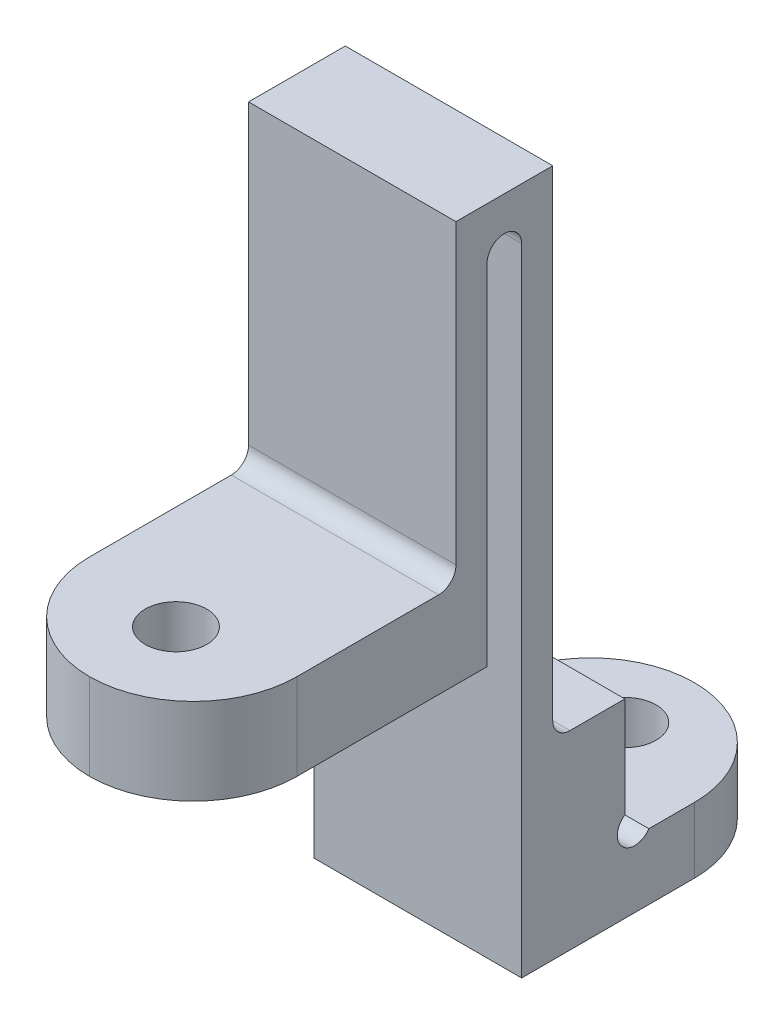
ISO-10303-21;
HEADER;
FILE_DESCRIPTION(('STEP AP214'),'2;1');
FILE_NAME('part.step','',(''),(''),'','','');
FILE_SCHEMA(('AUTOMOTIVE_DESIGN { 1 0 10303 214 1 1 1 1 }'));
ENDSEC;
DATA;
#1=APPLICATION_CONTEXT('core data for automotive mechanical design processes');
#2=APPLICATION_PROTOCOL_DEFINITION('international standard','automotive_design',2000,#1);
#3=PRODUCT_CONTEXT('',#1,'mechanical');
#4=PRODUCT('Part','Part','',(#3));
#5=PRODUCT_RELATED_PRODUCT_CATEGORY('part','',(#4));
#6=PRODUCT_DEFINITION_FORMATION('','',#4);
#7=PRODUCT_DEFINITION_CONTEXT('part definition',#1,'design');
#8=PRODUCT_DEFINITION('design','',#6,#7);
#9=PRODUCT_DEFINITION_SHAPE('','',#8);
#10=(LENGTH_UNIT() NAMED_UNIT(*) SI_UNIT(.MILLI.,.METRE.));
#11=(NAMED_UNIT(*) PLANE_ANGLE_UNIT() SI_UNIT($,.RADIAN.));
#12=(NAMED_UNIT(*) SI_UNIT($,.STERADIAN.) SOLID_ANGLE_UNIT());
#13=UNCERTAINTY_MEASURE_WITH_UNIT(LENGTH_MEASURE(1.E-05),#10,'distance_accuracy_value','');
#14=(GEOMETRIC_REPRESENTATION_CONTEXT(3) GLOBAL_UNCERTAINTY_ASSIGNED_CONTEXT((#13)) GLOBAL_UNIT_ASSIGNED_CONTEXT((#10,
#11,#12)) REPRESENTATION_CONTEXT('',''));
#15=CARTESIAN_POINT('',(0.,0.,0.));
#16=DIRECTION('',(0.,0.,1.));
#17=DIRECTION('',(1.,0.,0.));
#18=AXIS2_PLACEMENT_3D('',#15,#16,#17);
#19=CARTESIAN_POINT('',(1.5,-2.90242290122199,1.));
#20=DIRECTION('',(0.,-1.,0.));
#21=DIRECTION('',(0.,0.,-1.));
#22=AXIS2_PLACEMENT_3D('',#19,#20,#21);
#23=PLANE('',#22);
#24=CARTESIAN_POINT('',(4.5,-2.902422901222,-5.));
#25=DIRECTION('',(0.,1.,0.));
#26=DIRECTION('',(0.,0.,1.));
#27=AXIS2_PLACEMENT_3D('',#24,#25,#26);
#28=CIRCLE('',#27,0.888999999999999);
#29=CARTESIAN_POINT('',(4.5,-2.902422901222,-4.111));
#30=VERTEX_POINT('',#29);
#31=EDGE_CURVE('E487',#30,#30,#28,.T.);
#32=ORIENTED_EDGE('',*,*,#31,.T.);
#33=EDGE_LOOP('',(#32));
#34=FACE_BOUND('',#33,.T.);
#35=CARTESIAN_POINT('',(4.5,-2.90242290122199,-4.));
#36=DIRECTION('',(0.,-1.,0.));
#37=DIRECTION('',(0.,0.,-1.));
#38=AXIS2_PLACEMENT_3D('',#35,#36,#37);
#39=CIRCLE('',#38,3.);
#40=CARTESIAN_POINT('',(1.5,-2.90242290122199,-4.));
#41=VERTEX_POINT('',#40);
#42=CARTESIAN_POINT('',(4.5,-2.90242290122199,-7.));
#43=VERTEX_POINT('',#42);
#44=EDGE_CURVE('E315',#41,#43,#39,.T.);
#45=ORIENTED_EDGE('',*,*,#44,.T.);
#46=CARTESIAN_POINT('',(4.5,-2.90242290122199,-4.));
#47=DIRECTION('',(0.,-1.,0.));
#48=DIRECTION('',(0.,0.,-1.));
#49=AXIS2_PLACEMENT_3D('',#46,#47,#48);
#50=CIRCLE('',#49,3.);
#51=CARTESIAN_POINT('',(7.5,-2.90242290122199,-4.));
#52=VERTEX_POINT('',#51);
#53=EDGE_CURVE('E318',#43,#52,#50,.T.);
#54=ORIENTED_EDGE('',*,*,#53,.T.);
#55=DIRECTION('',(0.,0.,-1.));
#56=VECTOR('',#55,1.);
#57=CARTESIAN_POINT('',(7.5,-2.90242290122199,1.));
#58=LINE('',#57,#56);
#59=CARTESIAN_POINT('',(7.5,-2.90242290122199,1.));
#60=VERTEX_POINT('',#59);
#61=EDGE_CURVE('E244',#60,#52,#58,.T.);
#62=ORIENTED_EDGE('',*,*,#61,.F.);
#63=DIRECTION('',(1.,0.,0.));
#64=VECTOR('',#63,1.);
#65=CARTESIAN_POINT('',(1.5,-2.90242290122199,1.));
#66=LINE('',#65,#64);
#67=CARTESIAN_POINT('',(1.5,-2.90242290122199,1.));
#68=VERTEX_POINT('',#67);
#69=EDGE_CURVE('E285',#68,#60,#66,.T.);
#70=ORIENTED_EDGE('',*,*,#69,.F.);
#71=DIRECTION('',(0.,0.,-1.));
#72=VECTOR('',#71,1.);
#73=CARTESIAN_POINT('',(1.5,-2.90242290122199,1.));
#74=LINE('',#73,#72);
#75=EDGE_CURVE('E259',#68,#41,#74,.T.);
#76=ORIENTED_EDGE('',*,*,#75,.T.);
#77=EDGE_LOOP('',(#45,#54,#62,#70,#76));
#78=FACE_BOUND('',#77,.T.);
#79=ADVANCED_FACE('F45',(#34,#78),#23,.T.);
#80=CARTESIAN_POINT('',(1.5,-2.90242290122199,1.));
#81=DIRECTION('',(0.,0.,1.));
#82=DIRECTION('',(1.,0.,0.));
#83=AXIS2_PLACEMENT_3D('',#80,#81,#82);
#84=PLANE('',#83);
#85=DIRECTION('',(0.,-1.,0.));
#86=VECTOR('',#85,1.);
#87=CARTESIAN_POINT('',(7.5,-2.90242290122199,1.));
#88=LINE('',#87,#86);
#89=CARTESIAN_POINT('',(7.5,15.497577098778,1.));
#90=VERTEX_POINT('',#89);
#91=EDGE_CURVE('E278',#90,#60,#88,.T.);
#92=ORIENTED_EDGE('',*,*,#91,.F.);
#93=DIRECTION('',(1.,0.,0.));
#94=VECTOR('',#93,1.);
#95=CARTESIAN_POINT('',(1.5,15.497577098778,1.));
#96=LINE('',#95,#94);
#97=CARTESIAN_POINT('',(1.5,15.497577098778,1.));
#98=VERTEX_POINT('',#97);
#99=EDGE_CURVE('E289',#98,#90,#96,.T.);
#100=ORIENTED_EDGE('',*,*,#99,.F.);
#101=DIRECTION('',(0.,-1.,0.));
#102=VECTOR('',#101,1.);
#103=CARTESIAN_POINT('',(1.5,-2.90242290122199,1.));
#104=LINE('',#103,#102);
#105=EDGE_CURVE('E255',#98,#68,#104,.T.);
#106=ORIENTED_EDGE('',*,*,#105,.T.);
#107=ORIENTED_EDGE('',*,*,#69,.T.);
#108=EDGE_LOOP('',(#92,#100,#106,#107));
#109=FACE_BOUND('',#108,.T.);
#110=ADVANCED_FACE('F416',(#109),#84,.T.);
#111=CARTESIAN_POINT('',(1.5,15.497577098778,1.5));
#112=DIRECTION('',(1.,0.,0.));
#113=DIRECTION('',(0.,0.,-1.));
#114=AXIS2_PLACEMENT_3D('',#111,#112,#113);
#115=CYLINDRICAL_SURFACE('',#114,0.5);
#116=CARTESIAN_POINT('',(7.5,15.497577098778,1.5));
#117=DIRECTION('',(-1.,0.,0.));
#118=DIRECTION('',(0.,0.,1.));
#119=AXIS2_PLACEMENT_3D('',#116,#117,#118);
#120=CIRCLE('',#119,0.5);
#121=CARTESIAN_POINT('',(7.5,15.497577098778,2.));
#122=VERTEX_POINT('',#121);
#123=EDGE_CURVE('E274',#122,#90,#120,.T.);
#124=ORIENTED_EDGE('',*,*,#123,.F.);
#125=DIRECTION('',(1.,0.,0.));
#126=VECTOR('',#125,1.);
#127=CARTESIAN_POINT('',(1.5,15.497577098778,2.));
#128=LINE('',#127,#126);
#129=CARTESIAN_POINT('',(1.5,15.497577098778,2.));
#130=VERTEX_POINT('',#129);
#131=EDGE_CURVE('E292',#130,#122,#128,.T.);
#132=ORIENTED_EDGE('',*,*,#131,.F.);
#133=CARTESIAN_POINT('',(1.5,15.497577098778,1.5));
#134=DIRECTION('',(-1.,0.,0.));
#135=DIRECTION('',(0.,0.,1.));
#136=AXIS2_PLACEMENT_3D('',#133,#134,#135);
#137=CIRCLE('',#136,0.5);
#138=EDGE_CURVE('E251',#130,#98,#137,.T.);
#139=ORIENTED_EDGE('',*,*,#138,.T.);
#140=ORIENTED_EDGE('',*,*,#99,.T.);
#141=EDGE_LOOP('',(#124,#132,#139,#140));
#142=FACE_BOUND('',#141,.T.);
#143=ADVANCED_FACE('F422',(#142),#115,.F.);
#144=CARTESIAN_POINT('',(1.5,5.39757709877801,2.));
#145=DIRECTION('',(0.,0.,-1.));
#146=DIRECTION('',(-1.,0.,0.));
#147=AXIS2_PLACEMENT_3D('',#144,#145,#146);
#148=PLANE('',#147);
#149=DIRECTION('',(0.,1.,0.));
#150=VECTOR('',#149,1.);
#151=CARTESIAN_POINT('',(7.5,5.39757709877801,2.));
#152=LINE('',#151,#150);
#153=CARTESIAN_POINT('',(7.5,5.39757709877801,2.));
#154=VERTEX_POINT('',#153);
#155=EDGE_CURVE('E270',#154,#122,#152,.T.);
#156=ORIENTED_EDGE('',*,*,#155,.F.);
#157=DIRECTION('',(1.,0.,0.));
#158=VECTOR('',#157,1.);
#159=CARTESIAN_POINT('',(1.5,5.39757709877801,2.));
#160=LINE('',#159,#158);
#161=CARTESIAN_POINT('',(1.5,5.39757709877801,2.));
#162=VERTEX_POINT('',#161);
#163=EDGE_CURVE('E263',#162,#154,#160,.T.);
#164=ORIENTED_EDGE('',*,*,#163,.F.);
#165=DIRECTION('',(0.,1.,0.));
#166=VECTOR('',#165,1.);
#167=CARTESIAN_POINT('',(1.5,5.39757709877801,2.));
#168=LINE('',#167,#166);
#169=EDGE_CURVE('E247',#162,#130,#168,.T.);
#170=ORIENTED_EDGE('',*,*,#169,.T.);
#171=ORIENTED_EDGE('',*,*,#131,.T.);
#172=EDGE_LOOP('',(#156,#164,#170,#171));
#173=FACE_BOUND('',#172,.T.);
#174=ADVANCED_FACE('F432',(#173),#148,.T.);
#175=CARTESIAN_POINT('',(1.5,5.39757709877801,10.5));
#176=DIRECTION('',(0.,-1.,0.));
#177=DIRECTION('',(0.,0.,-1.));
#178=AXIS2_PLACEMENT_3D('',#175,#176,#177);
#179=PLANE('',#178);
#180=CARTESIAN_POINT('',(4.5,5.39757709877801,8.));
#181=DIRECTION('',(0.,-1.,0.));
#182=DIRECTION('',(0.,0.,-1.));
#183=AXIS2_PLACEMENT_3D('',#180,#181,#182);
#184=CIRCLE('',#183,0.888999999999999);
#185=CARTESIAN_POINT('',(4.5,5.39757709877801,7.111));
#186=VERTEX_POINT('',#185);
#187=EDGE_CURVE('E349',#186,#186,#184,.T.);
#188=ORIENTED_EDGE('',*,*,#187,.F.);
#189=EDGE_LOOP('',(#188));
#190=FACE_BOUND('',#189,.T.);
#191=CARTESIAN_POINT('',(4.5,5.39757709877801,7.5));
#192=DIRECTION('',(0.,-1.,0.));
#193=DIRECTION('',(0.,0.,-1.));
#194=AXIS2_PLACEMENT_3D('',#191,#192,#193);
#195=CIRCLE('',#194,3.);
#196=CARTESIAN_POINT('',(7.5,5.39757709877801,7.5));
#197=VERTEX_POINT('',#196);
#198=CARTESIAN_POINT('',(4.5,5.39757709877801,10.5));
#199=VERTEX_POINT('',#198);
#200=EDGE_CURVE('E328',#197,#199,#195,.T.);
#201=ORIENTED_EDGE('',*,*,#200,.T.);
#202=CARTESIAN_POINT('',(4.5,5.39757709877801,7.5));
#203=DIRECTION('',(0.,-1.,0.));
#204=DIRECTION('',(0.,0.,-1.));
#205=AXIS2_PLACEMENT_3D('',#202,#203,#204);
#206=CIRCLE('',#205,3.);
#207=CARTESIAN_POINT('',(1.5,5.39757709877801,7.5));
#208=VERTEX_POINT('',#207);
#209=EDGE_CURVE('E331',#199,#208,#206,.T.);
#210=ORIENTED_EDGE('',*,*,#209,.T.);
#211=DIRECTION('',(0.,0.,-1.));
#212=VECTOR('',#211,1.);
#213=CARTESIAN_POINT('',(1.5,5.39757709877801,10.5));
#214=LINE('',#213,#212);
#215=EDGE_CURVE('E243',#208,#162,#214,.T.);
#216=ORIENTED_EDGE('',*,*,#215,.T.);
#217=ORIENTED_EDGE('',*,*,#163,.T.);
#218=DIRECTION('',(0.,0.,-1.));
#219=VECTOR('',#218,1.);
#220=CARTESIAN_POINT('',(7.5,5.39757709877801,10.5));
#221=LINE('',#220,#219);
#222=EDGE_CURVE('E267',#197,#154,#221,.T.);
#223=ORIENTED_EDGE('',*,*,#222,.F.);
#224=EDGE_LOOP('',(#201,#210,#216,#217,#223));
#225=FACE_BOUND('',#224,.T.);
#226=ADVANCED_FACE('F436',(#190,#225),#179,.T.);
#227=CARTESIAN_POINT('',(1.5,16.997577098778,-7.));
#228=DIRECTION('',(0.,1.,0.));
#229=DIRECTION('',(0.,0.,1.));
#230=AXIS2_PLACEMENT_3D('',#227,#228,#229);
#231=PLANE('',#230);
#232=DIRECTION('',(-1.,0.,0.));
#233=VECTOR('',#232,1.);
#234=CARTESIAN_POINT('',(1.5,16.997577098778,2.9));
#235=LINE('',#234,#233);
#236=CARTESIAN_POINT('',(7.5,16.997577098778,2.9));
#237=VERTEX_POINT('',#236);
#238=CARTESIAN_POINT('',(1.5,16.997577098778,2.9));
#239=VERTEX_POINT('',#238);
#240=EDGE_CURVE('E235',#237,#239,#235,.T.);
#241=ORIENTED_EDGE('',*,*,#240,.F.);
#242=DIRECTION('',(0.,0.,1.));
#243=VECTOR('',#242,1.);
#244=CARTESIAN_POINT('',(7.5,16.997577098778,-7.));
#245=LINE('',#244,#243);
#246=CARTESIAN_POINT('',(7.5,16.997577098778,0.1));
#247=VERTEX_POINT('',#246);
#248=EDGE_CURVE('E238',#247,#237,#245,.T.);
#249=ORIENTED_EDGE('',*,*,#248,.F.);
#250=DIRECTION('',(1.,0.,0.));
#251=VECTOR('',#250,1.);
#252=CARTESIAN_POINT('',(1.5,16.997577098778,0.1));
#253=LINE('',#252,#251);
#254=CARTESIAN_POINT('',(1.5,16.997577098778,0.1));
#255=VERTEX_POINT('',#254);
#256=EDGE_CURVE('E220',#255,#247,#253,.T.);
#257=ORIENTED_EDGE('',*,*,#256,.F.);
#258=DIRECTION('',(0.,0.,1.));
#259=VECTOR('',#258,1.);
#260=CARTESIAN_POINT('',(1.5,16.997577098778,-7.));
#261=LINE('',#260,#259);
#262=EDGE_CURVE('E239',#255,#239,#261,.T.);
#263=ORIENTED_EDGE('',*,*,#262,.T.);
#264=EDGE_LOOP('',(#241,#249,#257,#263));
#265=FACE_BOUND('',#264,.T.);
#266=ADVANCED_FACE('F390',(#265),#231,.T.);
#267=CARTESIAN_POINT('',(1.5,15.497577098778,1.5));
#268=DIRECTION('',(-1.,0.,0.));
#269=DIRECTION('',(0.,0.,1.));
#270=AXIS2_PLACEMENT_3D('',#267,#268,#269);
#271=PLANE('',#270);
#272=CARTESIAN_POINT('',(1.5,-0.719580188747369,-2.26914504299253));
#273=DIRECTION('',(1.,0.,0.));
#274=DIRECTION('',(0.,0.,-1.));
#275=AXIS2_PLACEMENT_3D('',#272,#273,#274);
#276=CIRCLE('',#275,0.499999999999999);
#277=CARTESIAN_POINT('',(1.5,-0.307269626185604,-1.98630233051791));
#278=VERTEX_POINT('',#277);
#279=CARTESIAN_POINT('',(1.5,-1.00242290122199,-2.68145560555429));
#280=VERTEX_POINT('',#279);
#281=EDGE_CURVE('E178',#278,#280,#276,.T.);
#282=ORIENTED_EDGE('',*,*,#281,.T.);
#283=DIRECTION('',(0.,0.,1.));
#284=VECTOR('',#283,1.);
#285=CARTESIAN_POINT('',(1.5,-1.00242290122199,-1.98630233051791));
#286=LINE('',#285,#284);
#287=CARTESIAN_POINT('',(1.5,-1.00242290122199,-4.));
#288=VERTEX_POINT('',#287);
#289=EDGE_CURVE('E210',#288,#280,#286,.T.);
#290=ORIENTED_EDGE('',*,*,#289,.F.);
#291=DIRECTION('',(0.,1.,0.));
#292=VECTOR('',#291,1.);
#293=CARTESIAN_POINT('',(1.5,15.497577098778,-4.));
#294=LINE('',#293,#292);
#295=EDGE_CURVE('E325',#288,#41,#294,.F.);
#296=ORIENTED_EDGE('',*,*,#295,.T.);
#297=ORIENTED_EDGE('',*,*,#75,.F.);
#298=ORIENTED_EDGE('',*,*,#105,.F.);
#299=ORIENTED_EDGE('',*,*,#138,.F.);
#300=ORIENTED_EDGE('',*,*,#169,.F.);
#301=ORIENTED_EDGE('',*,*,#215,.F.);
#302=DIRECTION('',(0.,-1.,0.));
#303=VECTOR('',#302,1.);
#304=CARTESIAN_POINT('',(1.5,15.497577098778,7.5));
#305=LINE('',#304,#303);
#306=CARTESIAN_POINT('',(1.5,7.89757709877801,7.5));
#307=VERTEX_POINT('',#306);
#308=EDGE_CURVE('E321',#208,#307,#305,.F.);
#309=ORIENTED_EDGE('',*,*,#308,.T.);
#310=DIRECTION('',(0.,0.,1.));
#311=VECTOR('',#310,1.);
#312=CARTESIAN_POINT('',(1.5,7.89757709877801,2.9));
#313=LINE('',#312,#311);
#314=CARTESIAN_POINT('',(1.5,7.89757709877801,3.4));
#315=VERTEX_POINT('',#314);
#316=EDGE_CURVE('E204',#315,#307,#313,.T.);
#317=ORIENTED_EDGE('',*,*,#316,.F.);
#318=CARTESIAN_POINT('',(1.5,8.39757709877801,3.4));
#319=DIRECTION('',(-1.,0.,0.));
#320=DIRECTION('',(0.,0.,1.));
#321=AXIS2_PLACEMENT_3D('',#318,#319,#320);
#322=CIRCLE('',#321,0.5);
#323=CARTESIAN_POINT('',(1.5,8.39757709877802,2.9));
#324=VERTEX_POINT('',#323);
#325=EDGE_CURVE('E368',#315,#324,#322,.F.);
#326=ORIENTED_EDGE('',*,*,#325,.T.);
#327=DIRECTION('',(0.,-1.,0.));
#328=VECTOR('',#327,1.);
#329=CARTESIAN_POINT('',(1.5,17.497577098778,2.9));
#330=LINE('',#329,#328);
#331=EDGE_CURVE('E217',#239,#324,#330,.T.);
#332=ORIENTED_EDGE('',*,*,#331,.F.);
#333=ORIENTED_EDGE('',*,*,#262,.F.);
#334=DIRECTION('',(0.,1.,0.));
#335=VECTOR('',#334,1.);
#336=CARTESIAN_POINT('',(1.5,17.497577098778,0.1));
#337=LINE('',#336,#335);
#338=CARTESIAN_POINT('',(1.5,3.09757709877801,0.100000000000003));
#339=VERTEX_POINT('',#338);
#340=EDGE_CURVE('E224',#339,#255,#337,.T.);
#341=ORIENTED_EDGE('',*,*,#340,.F.);
#342=CARTESIAN_POINT('',(1.5,3.09757709877801,-0.399999999999997));
#343=DIRECTION('',(-1.,0.,0.));
#344=DIRECTION('',(0.,0.,1.));
#345=AXIS2_PLACEMENT_3D('',#342,#343,#344);
#346=CIRCLE('',#345,0.5);
#347=CARTESIAN_POINT('',(1.5,2.59757709877801,-0.399999999999997));
#348=VERTEX_POINT('',#347);
#349=EDGE_CURVE('E362',#339,#348,#346,.F.);
#350=ORIENTED_EDGE('',*,*,#349,.T.);
#351=DIRECTION('',(0.,0.,1.));
#352=VECTOR('',#351,1.);
#353=CARTESIAN_POINT('',(1.5,2.59757709877801,0.100000000000003));
#354=LINE('',#353,#352);
#355=CARTESIAN_POINT('',(1.5,2.59757709877801,-1.98630233051791));
#356=VERTEX_POINT('',#355);
#357=EDGE_CURVE('E225',#356,#348,#354,.T.);
#358=ORIENTED_EDGE('',*,*,#357,.F.);
#359=DIRECTION('',(0.,1.,0.));
#360=VECTOR('',#359,1.);
#361=CARTESIAN_POINT('',(1.5,-1.00242290122199,-1.98630233051791));
#362=LINE('',#361,#360);
#363=EDGE_CURVE('E206',#278,#356,#362,.T.);
#364=ORIENTED_EDGE('',*,*,#363,.F.);
#365=EDGE_LOOP('',(#282,#290,#296,#297,#298,#299,#300,#301,#309,#317,#326,#332,#333,#341,#350,
#358,#364));
#366=FACE_BOUND('',#365,.T.);
#367=ADVANCED_FACE('F384',(#366),#271,.T.);
#368=CARTESIAN_POINT('',(7.5,15.497577098778,1.5));
#369=DIRECTION('',(-1.,0.,0.));
#370=DIRECTION('',(0.,0.,1.));
#371=AXIS2_PLACEMENT_3D('',#368,#369,#370);
#372=PLANE('',#371);
#373=DIRECTION('',(0.,0.,1.));
#374=VECTOR('',#373,1.);
#375=CARTESIAN_POINT('',(7.5,-1.00242290122199,-1.98630233051791));
#376=LINE('',#375,#374);
#377=CARTESIAN_POINT('',(7.5,-1.00242290122199,-4.));
#378=VERTEX_POINT('',#377);
#379=CARTESIAN_POINT('',(7.5,-1.00242290122199,-2.68145560555429));
#380=VERTEX_POINT('',#379);
#381=EDGE_CURVE('E193',#378,#380,#376,.T.);
#382=ORIENTED_EDGE('',*,*,#381,.T.);
#383=CARTESIAN_POINT('',(7.5,-0.719580188747369,-2.26914504299253));
#384=DIRECTION('',(1.,0.,0.));
#385=DIRECTION('',(0.,0.,-1.));
#386=AXIS2_PLACEMENT_3D('',#383,#384,#385);
#387=CIRCLE('',#386,0.499999999999999);
#388=CARTESIAN_POINT('',(7.5,-0.307269626185604,-1.98630233051791));
#389=VERTEX_POINT('',#388);
#390=EDGE_CURVE('E61',#389,#380,#387,.T.);
#391=ORIENTED_EDGE('',*,*,#390,.F.);
#392=DIRECTION('',(0.,1.,0.));
#393=VECTOR('',#392,1.);
#394=CARTESIAN_POINT('',(7.5,-1.00242290122199,-1.98630233051791));
#395=LINE('',#394,#393);
#396=CARTESIAN_POINT('',(7.5,2.59757709877801,-1.98630233051791));
#397=VERTEX_POINT('',#396);
#398=EDGE_CURVE('E189',#389,#397,#395,.T.);
#399=ORIENTED_EDGE('',*,*,#398,.T.);
#400=DIRECTION('',(0.,0.,1.));
#401=VECTOR('',#400,1.);
#402=CARTESIAN_POINT('',(7.5,2.59757709877801,1.5));
#403=LINE('',#402,#401);
#404=CARTESIAN_POINT('',(7.5,2.59757709877801,-0.399999999999997));
#405=VERTEX_POINT('',#404);
#406=EDGE_CURVE('E288',#397,#405,#403,.T.);
#407=ORIENTED_EDGE('',*,*,#406,.T.);
#408=CARTESIAN_POINT('',(7.5,3.09757709877801,-0.399999999999997));
#409=DIRECTION('',(-1.,0.,0.));
#410=DIRECTION('',(0.,0.,1.));
#411=AXIS2_PLACEMENT_3D('',#408,#409,#410);
#412=CIRCLE('',#411,0.5);
#413=CARTESIAN_POINT('',(7.5,3.09757709877801,0.100000000000003));
#414=VERTEX_POINT('',#413);
#415=EDGE_CURVE('E365',#405,#414,#412,.T.);
#416=ORIENTED_EDGE('',*,*,#415,.T.);
#417=DIRECTION('',(0.,1.,0.));
#418=VECTOR('',#417,1.);
#419=CARTESIAN_POINT('',(7.5,17.497577098778,0.1));
#420=LINE('',#419,#418);
#421=EDGE_CURVE('E221',#414,#247,#420,.T.);
#422=ORIENTED_EDGE('',*,*,#421,.T.);
#423=ORIENTED_EDGE('',*,*,#248,.T.);
#424=DIRECTION('',(0.,-1.,0.));
#425=VECTOR('',#424,1.);
#426=CARTESIAN_POINT('',(7.5,15.497577098778,2.9));
#427=LINE('',#426,#425);
#428=CARTESIAN_POINT('',(7.5,8.39757709877801,2.9));
#429=VERTEX_POINT('',#428);
#430=EDGE_CURVE('E300',#237,#429,#427,.T.);
#431=ORIENTED_EDGE('',*,*,#430,.T.);
#432=CARTESIAN_POINT('',(7.5,8.39757709877801,3.4));
#433=DIRECTION('',(-1.,0.,0.));
#434=DIRECTION('',(0.,0.,1.));
#435=AXIS2_PLACEMENT_3D('',#432,#433,#434);
#436=CIRCLE('',#435,0.5);
#437=CARTESIAN_POINT('',(7.5,7.89757709877801,3.4));
#438=VERTEX_POINT('',#437);
#439=EDGE_CURVE('E54',#429,#438,#436,.T.);
#440=ORIENTED_EDGE('',*,*,#439,.T.);
#441=DIRECTION('',(0.,0.,1.));
#442=VECTOR('',#441,1.);
#443=CARTESIAN_POINT('',(7.5,7.89757709877801,2.9));
#444=LINE('',#443,#442);
#445=CARTESIAN_POINT('',(7.5,7.89757709877801,7.5));
#446=VERTEX_POINT('',#445);
#447=EDGE_CURVE('E229',#438,#446,#444,.T.);
#448=ORIENTED_EDGE('',*,*,#447,.T.);
#449=DIRECTION('',(0.,-1.,0.));
#450=VECTOR('',#449,1.);
#451=CARTESIAN_POINT('',(7.5,5.39757709877801,7.5));
#452=LINE('',#451,#450);
#453=EDGE_CURVE('E303',#446,#197,#452,.T.);
#454=ORIENTED_EDGE('',*,*,#453,.T.);
#455=ORIENTED_EDGE('',*,*,#222,.T.);
#456=ORIENTED_EDGE('',*,*,#155,.T.);
#457=ORIENTED_EDGE('',*,*,#123,.T.);
#458=ORIENTED_EDGE('',*,*,#91,.T.);
#459=ORIENTED_EDGE('',*,*,#61,.T.);
#460=DIRECTION('',(0.,1.,0.));
#461=VECTOR('',#460,1.);
#462=CARTESIAN_POINT('',(7.5,-1.00242290122199,-4.));
#463=LINE('',#462,#461);
#464=EDGE_CURVE('E306',#52,#378,#463,.T.);
#465=ORIENTED_EDGE('',*,*,#464,.T.);
#466=EDGE_LOOP('',(#382,#391,#399,#407,#416,#422,#423,#431,#440,#448,#454,#455,#456,#457,#458,
#459,#465));
#467=FACE_BOUND('',#466,.T.);
#468=ADVANCED_FACE('F187',(#467),#372,.F.);
#469=CARTESIAN_POINT('',(7.5,17.497577098778,0.1));
#470=DIRECTION('',(0.,0.,1.));
#471=DIRECTION('',(0.,-1.,0.));
#472=AXIS2_PLACEMENT_3D('',#469,#470,#471);
#473=PLANE('',#472);
#474=ORIENTED_EDGE('',*,*,#421,.F.);
#475=DIRECTION('',(-1.,0.,0.));
#476=VECTOR('',#475,1.);
#477=CARTESIAN_POINT('',(1.5,3.09757709877801,0.100000000000003));
#478=LINE('',#477,#476);
#479=EDGE_CURVE('E341',#414,#339,#478,.T.);
#480=ORIENTED_EDGE('',*,*,#479,.T.);
#481=ORIENTED_EDGE('',*,*,#340,.T.);
#482=ORIENTED_EDGE('',*,*,#256,.T.);
#483=EDGE_LOOP('',(#474,#480,#481,#482));
#484=FACE_BOUND('',#483,.T.);
#485=ADVANCED_FACE('F396',(#484),#473,.F.);
#486=CARTESIAN_POINT('',(7.5,2.59757709877801,0.100000000000003));
#487=DIRECTION('',(0.,-1.,0.));
#488=DIRECTION('',(0.,0.,-1.));
#489=AXIS2_PLACEMENT_3D('',#486,#487,#488);
#490=PLANE('',#489);
#491=ORIENTED_EDGE('',*,*,#357,.T.);
#492=DIRECTION('',(-1.,0.,0.));
#493=VECTOR('',#492,1.);
#494=CARTESIAN_POINT('',(7.5,2.59757709877801,-0.399999999999997));
#495=LINE('',#494,#493);
#496=EDGE_CURVE('E353',#348,#405,#495,.F.);
#497=ORIENTED_EDGE('',*,*,#496,.T.);
#498=ORIENTED_EDGE('',*,*,#406,.F.);
#499=DIRECTION('',(-1.,0.,0.));
#500=VECTOR('',#499,1.);
#501=CARTESIAN_POINT('',(7.5,2.59757709877801,-1.98630233051791));
#502=LINE('',#501,#500);
#503=EDGE_CURVE('E198',#397,#356,#502,.T.);
#504=ORIENTED_EDGE('',*,*,#503,.T.);
#505=EDGE_LOOP('',(#491,#497,#498,#504));
#506=FACE_BOUND('',#505,.T.);
#507=ADVANCED_FACE('F402',(#506),#490,.F.);
#508=CARTESIAN_POINT('',(7.5,17.497577098778,2.9));
#509=DIRECTION('',(0.,0.,-1.));
#510=DIRECTION('',(0.,1.,0.));
#511=AXIS2_PLACEMENT_3D('',#508,#509,#510);
#512=PLANE('',#511);
#513=ORIENTED_EDGE('',*,*,#331,.T.);
#514=DIRECTION('',(-1.,0.,0.));
#515=VECTOR('',#514,1.);
#516=CARTESIAN_POINT('',(7.5,8.39757709877801,2.9));
#517=LINE('',#516,#515);
#518=EDGE_CURVE('E68',#324,#429,#517,.F.);
#519=ORIENTED_EDGE('',*,*,#518,.T.);
#520=ORIENTED_EDGE('',*,*,#430,.F.);
#521=ORIENTED_EDGE('',*,*,#240,.T.);
#522=EDGE_LOOP('',(#513,#519,#520,#521));
#523=FACE_BOUND('',#522,.T.);
#524=ADVANCED_FACE('F386',(#523),#512,.F.);
#525=CARTESIAN_POINT('',(7.5,7.89757709877801,2.9));
#526=DIRECTION('',(0.,-1.,0.));
#527=DIRECTION('',(0.,0.,-1.));
#528=AXIS2_PLACEMENT_3D('',#525,#526,#527);
#529=PLANE('',#528);
#530=CARTESIAN_POINT('',(4.5,7.89757709877801,8.));
#531=DIRECTION('',(0.,1.,0.));
#532=DIRECTION('',(0.,0.,1.));
#533=AXIS2_PLACEMENT_3D('',#530,#531,#532);
#534=CIRCLE('',#533,0.889);
#535=CARTESIAN_POINT('',(4.5,7.89757709877801,8.889));
#536=VERTEX_POINT('',#535);
#537=EDGE_CURVE('E490',#536,#536,#534,.T.);
#538=ORIENTED_EDGE('',*,*,#537,.F.);
#539=EDGE_LOOP('',(#538));
#540=FACE_BOUND('',#539,.T.);
#541=ORIENTED_EDGE('',*,*,#447,.F.);
#542=DIRECTION('',(-1.,0.,0.));
#543=VECTOR('',#542,1.);
#544=CARTESIAN_POINT('',(1.5,7.89757709877801,3.4));
#545=LINE('',#544,#543);
#546=EDGE_CURVE('E356',#438,#315,#545,.T.);
#547=ORIENTED_EDGE('',*,*,#546,.T.);
#548=ORIENTED_EDGE('',*,*,#316,.T.);
#549=CARTESIAN_POINT('',(4.5,7.89757709877801,7.5));
#550=DIRECTION('',(0.,-1.,0.));
#551=DIRECTION('',(0.,0.,-1.));
#552=AXIS2_PLACEMENT_3D('',#549,#550,#551);
#553=CIRCLE('',#552,3.);
#554=CARTESIAN_POINT('',(4.5,7.89757709877801,10.5));
#555=VERTEX_POINT('',#554);
#556=EDGE_CURVE('E338',#307,#555,#553,.F.);
#557=ORIENTED_EDGE('',*,*,#556,.T.);
#558=CARTESIAN_POINT('',(4.5,7.89757709877801,7.5));
#559=DIRECTION('',(0.,-1.,0.));
#560=DIRECTION('',(0.,0.,-1.));
#561=AXIS2_PLACEMENT_3D('',#558,#559,#560);
#562=CIRCLE('',#561,3.);
#563=EDGE_CURVE('E334',#555,#446,#562,.F.);
#564=ORIENTED_EDGE('',*,*,#563,.T.);
#565=EDGE_LOOP('',(#541,#547,#548,#557,#564));
#566=FACE_BOUND('',#565,.T.);
#567=ADVANCED_FACE('F376',(#540,#566),#529,.F.);
#568=CARTESIAN_POINT('',(7.5,-1.00242290122199,-1.98630233051791));
#569=DIRECTION('',(0.,0.,1.));
#570=DIRECTION('',(0.,-1.,0.));
#571=AXIS2_PLACEMENT_3D('',#568,#569,#570);
#572=PLANE('',#571);
#573=ORIENTED_EDGE('',*,*,#398,.F.);
#574=DIRECTION('',(1.,0.,0.));
#575=VECTOR('',#574,1.);
#576=CARTESIAN_POINT('',(1.5,-0.307269626185604,-1.98630233051791));
#577=LINE('',#576,#575);
#578=EDGE_CURVE('E175',#389,#278,#577,.F.);
#579=ORIENTED_EDGE('',*,*,#578,.T.);
#580=ORIENTED_EDGE('',*,*,#363,.T.);
#581=ORIENTED_EDGE('',*,*,#503,.F.);
#582=EDGE_LOOP('',(#573,#579,#580,#581));
#583=FACE_BOUND('',#582,.T.);
#584=ADVANCED_FACE('F196',(#583),#572,.F.);
#585=CARTESIAN_POINT('',(7.5,-1.00242290122199,-1.98630233051791));
#586=DIRECTION('',(0.,-1.,0.));
#587=DIRECTION('',(0.,0.,-1.));
#588=AXIS2_PLACEMENT_3D('',#585,#586,#587);
#589=PLANE('',#588);
#590=CARTESIAN_POINT('',(4.5,-1.00242290122199,-5.));
#591=DIRECTION('',(0.,1.,0.));
#592=DIRECTION('',(0.,0.,1.));
#593=AXIS2_PLACEMENT_3D('',#590,#591,#592);
#594=CIRCLE('',#593,0.888999999999999);
#595=CARTESIAN_POINT('',(4.5,-1.00242290122199,-4.111));
#596=VERTEX_POINT('',#595);
#597=EDGE_CURVE('E183',#596,#596,#594,.T.);
#598=ORIENTED_EDGE('',*,*,#597,.F.);
#599=EDGE_LOOP('',(#598));
#600=FACE_BOUND('',#599,.T.);
#601=ORIENTED_EDGE('',*,*,#289,.T.);
#602=DIRECTION('',(1.,0.,0.));
#603=VECTOR('',#602,1.);
#604=CARTESIAN_POINT('',(1.5,-1.00242290122199,-2.68145560555429));
#605=LINE('',#604,#603);
#606=EDGE_CURVE('E11',#280,#380,#605,.T.);
#607=ORIENTED_EDGE('',*,*,#606,.T.);
#608=ORIENTED_EDGE('',*,*,#381,.F.);
#609=CARTESIAN_POINT('',(4.5,-1.00242290122199,-4.));
#610=DIRECTION('',(0.,-1.,0.));
#611=DIRECTION('',(0.,0.,-1.));
#612=AXIS2_PLACEMENT_3D('',#609,#610,#611);
#613=CIRCLE('',#612,3.);
#614=CARTESIAN_POINT('',(4.5,-1.00242290122199,-7.));
#615=VERTEX_POINT('',#614);
#616=EDGE_CURVE('E312',#378,#615,#613,.F.);
#617=ORIENTED_EDGE('',*,*,#616,.T.);
#618=CARTESIAN_POINT('',(4.5,-1.00242290122199,-4.));
#619=DIRECTION('',(0.,-1.,0.));
#620=DIRECTION('',(0.,0.,-1.));
#621=AXIS2_PLACEMENT_3D('',#618,#619,#620);
#622=CIRCLE('',#621,3.);
#623=EDGE_CURVE('E309',#615,#288,#622,.F.);
#624=ORIENTED_EDGE('',*,*,#623,.T.);
#625=EDGE_LOOP('',(#601,#607,#608,#617,#624));
#626=FACE_BOUND('',#625,.T.);
#627=ADVANCED_FACE('F451',(#600,#626),#589,.F.);
#628=CARTESIAN_POINT('',(4.5,-2.90242290122199,-4.));
#629=DIRECTION('',(0.,1.,0.));
#630=DIRECTION('',(0.,0.,1.));
#631=AXIS2_PLACEMENT_3D('',#628,#629,#630);
#632=CYLINDRICAL_SURFACE('',#631,3.);
#633=DIRECTION('',(0.,1.,0.));
#634=VECTOR('',#633,1.);
#635=CARTESIAN_POINT('',(4.5,-2.90242290122199,-7.));
#636=LINE('',#635,#634);
#637=EDGE_CURVE('E214',#43,#615,#636,.T.);
#638=ORIENTED_EDGE('',*,*,#637,.F.);
#639=ORIENTED_EDGE('',*,*,#44,.F.);
#640=ORIENTED_EDGE('',*,*,#295,.F.);
#641=ORIENTED_EDGE('',*,*,#623,.F.);
#642=EDGE_LOOP('',(#638,#639,#640,#641));
#643=FACE_BOUND('',#642,.T.);
#644=ADVANCED_FACE('F447',(#643),#632,.T.);
#645=CARTESIAN_POINT('',(4.5,15.497577098778,-4.));
#646=DIRECTION('',(0.,-1.,0.));
#647=DIRECTION('',(0.,0.,-1.));
#648=AXIS2_PLACEMENT_3D('',#645,#646,#647);
#649=CYLINDRICAL_SURFACE('',#648,3.);
#650=ORIENTED_EDGE('',*,*,#53,.F.);
#651=ORIENTED_EDGE('',*,*,#637,.T.);
#652=ORIENTED_EDGE('',*,*,#616,.F.);
#653=ORIENTED_EDGE('',*,*,#464,.F.);
#654=EDGE_LOOP('',(#650,#651,#652,#653));
#655=FACE_BOUND('',#654,.T.);
#656=ADVANCED_FACE('F443',(#655),#649,.T.);
#657=CARTESIAN_POINT('',(4.5,15.497577098778,7.5));
#658=DIRECTION('',(0.,1.,0.));
#659=DIRECTION('',(0.,0.,1.));
#660=AXIS2_PLACEMENT_3D('',#657,#658,#659);
#661=CYLINDRICAL_SURFACE('',#660,3.);
#662=ORIENTED_EDGE('',*,*,#453,.F.);
#663=ORIENTED_EDGE('',*,*,#563,.F.);
#664=DIRECTION('',(0.,-1.,0.));
#665=VECTOR('',#664,1.);
#666=CARTESIAN_POINT('',(4.5,7.89757709877801,10.5));
#667=LINE('',#666,#665);
#668=EDGE_CURVE('E345',#199,#555,#667,.F.);
#669=ORIENTED_EDGE('',*,*,#668,.F.);
#670=ORIENTED_EDGE('',*,*,#200,.F.);
#671=EDGE_LOOP('',(#662,#663,#669,#670));
#672=FACE_BOUND('',#671,.T.);
#673=ADVANCED_FACE('F446',(#672),#661,.T.);
#674=CARTESIAN_POINT('',(4.5,16.997577098778,7.5));
#675=DIRECTION('',(0.,-1.,0.));
#676=DIRECTION('',(0.,0.,-1.));
#677=AXIS2_PLACEMENT_3D('',#674,#675,#676);
#678=CYLINDRICAL_SURFACE('',#677,3.);
#679=ORIENTED_EDGE('',*,*,#556,.F.);
#680=ORIENTED_EDGE('',*,*,#308,.F.);
#681=ORIENTED_EDGE('',*,*,#209,.F.);
#682=ORIENTED_EDGE('',*,*,#668,.T.);
#683=EDGE_LOOP('',(#679,#680,#681,#682));
#684=FACE_BOUND('',#683,.T.);
#685=ADVANCED_FACE('F411',(#684),#678,.T.);
#686=CARTESIAN_POINT('',(4.5,7.89757709877801,8.));
#687=DIRECTION('',(0.,1.,0.));
#688=DIRECTION('',(0.,0.,1.));
#689=AXIS2_PLACEMENT_3D('',#686,#687,#688);
#690=CYLINDRICAL_SURFACE('',#689,0.888999999999999);
#691=ORIENTED_EDGE('',*,*,#187,.T.);
#692=EDGE_LOOP('',(#691));
#693=FACE_BOUND('',#692,.T.);
#694=ORIENTED_EDGE('',*,*,#537,.T.);
#695=EDGE_LOOP('',(#694));
#696=FACE_BOUND('',#695,.T.);
#697=ADVANCED_FACE('F405',(#693,#696),#690,.F.);
#698=CARTESIAN_POINT('',(7.5,3.09757709877801,-0.399999999999997));
#699=DIRECTION('',(1.,0.,0.));
#700=DIRECTION('',(0.,0.,-1.));
#701=AXIS2_PLACEMENT_3D('',#698,#699,#700);
#702=CYLINDRICAL_SURFACE('',#701,0.5);
#703=ORIENTED_EDGE('',*,*,#415,.F.);
#704=ORIENTED_EDGE('',*,*,#496,.F.);
#705=ORIENTED_EDGE('',*,*,#349,.F.);
#706=ORIENTED_EDGE('',*,*,#479,.F.);
#707=EDGE_LOOP('',(#703,#704,#705,#706));
#708=FACE_BOUND('',#707,.T.);
#709=ADVANCED_FACE('F403',(#708),#702,.F.);
#710=CARTESIAN_POINT('',(7.5,8.39757709877801,3.4));
#711=DIRECTION('',(1.,0.,0.));
#712=DIRECTION('',(0.,0.,-1.));
#713=AXIS2_PLACEMENT_3D('',#710,#711,#712);
#714=CYLINDRICAL_SURFACE('',#713,0.5);
#715=ORIENTED_EDGE('',*,*,#439,.F.);
#716=ORIENTED_EDGE('',*,*,#518,.F.);
#717=ORIENTED_EDGE('',*,*,#325,.F.);
#718=ORIENTED_EDGE('',*,*,#546,.F.);
#719=EDGE_LOOP('',(#715,#716,#717,#718));
#720=FACE_BOUND('',#719,.T.);
#721=ADVANCED_FACE('F47',(#720),#714,.F.);
#722=CARTESIAN_POINT('',(4.5,-1.00242290122199,-5.));
#723=DIRECTION('',(0.,1.,0.));
#724=DIRECTION('',(0.,0.,1.));
#725=AXIS2_PLACEMENT_3D('',#722,#723,#724);
#726=CYLINDRICAL_SURFACE('',#725,0.888999999999999);
#727=ORIENTED_EDGE('',*,*,#31,.F.);
#728=EDGE_LOOP('',(#727));
#729=FACE_BOUND('',#728,.T.);
#730=ORIENTED_EDGE('',*,*,#597,.T.);
#731=EDGE_LOOP('',(#730));
#732=FACE_BOUND('',#731,.T.);
#733=ADVANCED_FACE('F410',(#729,#732),#726,.F.);
#734=CARTESIAN_POINT('',(1.5,-0.719580188747369,-2.26914504299253));
#735=DIRECTION('',(1.,0.,0.));
#736=DIRECTION('',(0.,0.,-1.));
#737=AXIS2_PLACEMENT_3D('',#734,#735,#736);
#738=CYLINDRICAL_SURFACE('',#737,0.499999999999999);
#739=ORIENTED_EDGE('',*,*,#390,.T.);
#740=ORIENTED_EDGE('',*,*,#606,.F.);
#741=ORIENTED_EDGE('',*,*,#281,.F.);
#742=ORIENTED_EDGE('',*,*,#578,.F.);
#743=EDGE_LOOP('',(#739,#740,#741,#742));
#744=FACE_BOUND('',#743,.T.);
#745=ADVANCED_FACE('F176',(#744),#738,.F.);
#746=CLOSED_SHELL('',(#79,#110,#143,#174,#226,#266,#367,#468,#485,#507,#524,#567,#584,#627,#644,
#656,#673,#685,#697,#709,#721,#733,#745));
#747=MANIFOLD_SOLID_BREP('B2',#746);
#748=ADVANCED_BREP_SHAPE_REPRESENTATION('',(#18,#747),#14);
#749=SHAPE_DEFINITION_REPRESENTATION(#9,#748);
ENDSEC;
END-ISO-10303-21;
